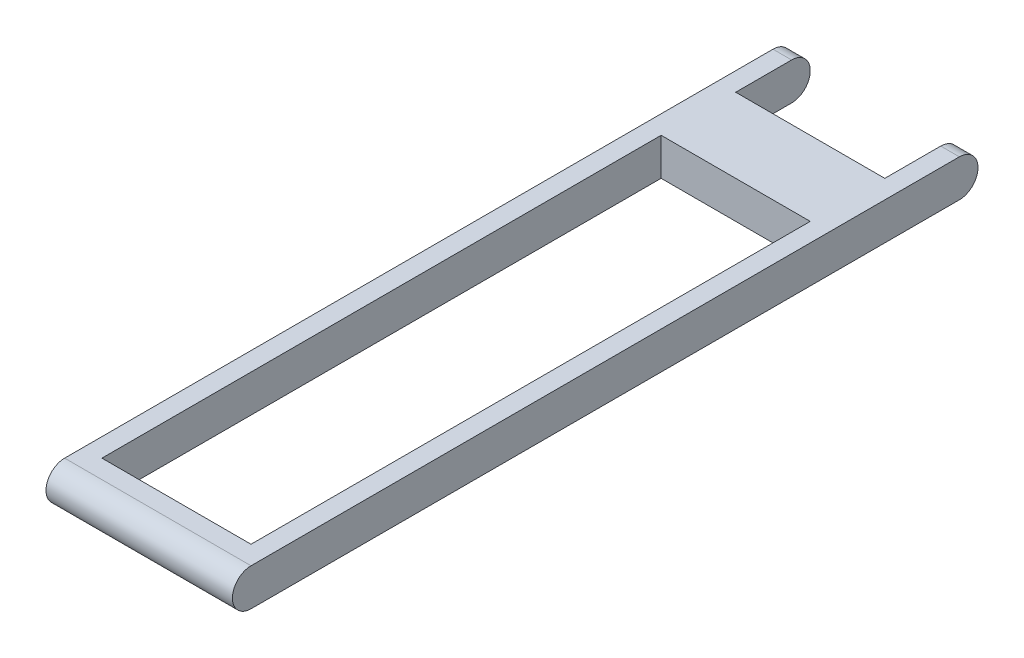
ISO-10303-21;
HEADER;
FILE_DESCRIPTION(('STEP AP214'),'2;1');
FILE_NAME('part.step','',(''),(''),'','','');
FILE_SCHEMA(('AUTOMOTIVE_DESIGN { 1 0 10303 214 1 1 1 1 }'));
ENDSEC;
DATA;
#1=APPLICATION_CONTEXT('core data for automotive mechanical design processes');
#2=APPLICATION_PROTOCOL_DEFINITION('international standard','automotive_design',2000,#1);
#3=PRODUCT_CONTEXT('',#1,'mechanical');
#4=PRODUCT('Part','Part','',(#3));
#5=PRODUCT_RELATED_PRODUCT_CATEGORY('part','',(#4));
#6=PRODUCT_DEFINITION_FORMATION('','',#4);
#7=PRODUCT_DEFINITION_CONTEXT('part definition',#1,'design');
#8=PRODUCT_DEFINITION('design','',#6,#7);
#9=PRODUCT_DEFINITION_SHAPE('','',#8);
#10=(LENGTH_UNIT() NAMED_UNIT(*) SI_UNIT(.MILLI.,.METRE.));
#11=(NAMED_UNIT(*) PLANE_ANGLE_UNIT() SI_UNIT($,.RADIAN.));
#12=(NAMED_UNIT(*) SI_UNIT($,.STERADIAN.) SOLID_ANGLE_UNIT());
#13=UNCERTAINTY_MEASURE_WITH_UNIT(LENGTH_MEASURE(1.E-05),#10,'distance_accuracy_value','');
#14=(GEOMETRIC_REPRESENTATION_CONTEXT(3) GLOBAL_UNCERTAINTY_ASSIGNED_CONTEXT((#13)) GLOBAL_UNIT_ASSIGNED_CONTEXT((#10,
#11,#12)) REPRESENTATION_CONTEXT('',''));
#15=CARTESIAN_POINT('',(0.,0.,0.));
#16=DIRECTION('',(0.,0.,1.));
#17=DIRECTION('',(1.,0.,0.));
#18=AXIS2_PLACEMENT_3D('',#15,#16,#17);
#19=CARTESIAN_POINT('',(10.,0.,-19.));
#20=DIRECTION('',(-1.,0.,0.));
#21=DIRECTION('',(0.,0.,1.));
#22=AXIS2_PLACEMENT_3D('',#19,#20,#21);
#23=CYLINDRICAL_SURFACE('',#22,1.);
#24=DIRECTION('',(-1.,0.,0.));
#25=VECTOR('',#24,1.);
#26=CARTESIAN_POINT('',(10.,1.00000000000001,-19.));
#27=LINE('',#26,#25);
#28=CARTESIAN_POINT('',(0.999999999999998,1.00000000000001,-19.));
#29=VERTEX_POINT('',#28);
#30=CARTESIAN_POINT('',(0.,1.00000000000001,-19.));
#31=VERTEX_POINT('',#30);
#32=EDGE_CURVE('E207',#29,#31,#27,.T.);
#33=ORIENTED_EDGE('',*,*,#32,.F.);
#34=CARTESIAN_POINT('',(0.999999999999997,0.,-19.));
#35=DIRECTION('',(-1.,0.,0.));
#36=DIRECTION('',(0.,0.,1.));
#37=AXIS2_PLACEMENT_3D('',#34,#35,#36);
#38=CIRCLE('',#37,1.);
#39=CARTESIAN_POINT('',(0.999999999999997,-0.999999999999993,-19.));
#40=VERTEX_POINT('',#39);
#41=EDGE_CURVE('E169',#29,#40,#38,.T.);
#42=ORIENTED_EDGE('',*,*,#41,.T.);
#43=DIRECTION('',(-1.,0.,0.));
#44=VECTOR('',#43,1.);
#45=CARTESIAN_POINT('',(10.,-0.999999999999993,-19.));
#46=LINE('',#45,#44);
#47=CARTESIAN_POINT('',(0.,-0.999999999999993,-19.));
#48=VERTEX_POINT('',#47);
#49=EDGE_CURVE('E211',#40,#48,#46,.T.);
#50=ORIENTED_EDGE('',*,*,#49,.T.);
#51=CARTESIAN_POINT('',(0.,0.,-19.));
#52=DIRECTION('',(1.,0.,0.));
#53=DIRECTION('',(0.,0.,-1.));
#54=AXIS2_PLACEMENT_3D('',#51,#52,#53);
#55=CIRCLE('',#54,1.);
#56=EDGE_CURVE('E201',#48,#31,#55,.T.);
#57=ORIENTED_EDGE('',*,*,#56,.T.);
#58=EDGE_LOOP('',(#33,#42,#50,#57));
#59=FACE_BOUND('',#58,.T.);
#60=ADVANCED_FACE('F34',(#59),#23,.T.);
#61=CARTESIAN_POINT('',(10.,0.,19.));
#62=DIRECTION('',(-1.,0.,0.));
#63=DIRECTION('',(0.,0.,1.));
#64=AXIS2_PLACEMENT_3D('',#61,#62,#63);
#65=CYLINDRICAL_SURFACE('',#64,1.);
#66=CARTESIAN_POINT('',(0.,0.,19.));
#67=DIRECTION('',(1.,0.,0.));
#68=DIRECTION('',(0.,0.,-1.));
#69=AXIS2_PLACEMENT_3D('',#66,#67,#68);
#70=CIRCLE('',#69,1.);
#71=CARTESIAN_POINT('',(0.,1.,19.));
#72=VERTEX_POINT('',#71);
#73=CARTESIAN_POINT('',(0.,-1.,19.));
#74=VERTEX_POINT('',#73);
#75=EDGE_CURVE('E184',#72,#74,#70,.T.);
#76=ORIENTED_EDGE('',*,*,#75,.T.);
#77=DIRECTION('',(-1.,0.,0.));
#78=VECTOR('',#77,1.);
#79=CARTESIAN_POINT('',(10.,-1.,19.));
#80=LINE('',#79,#78);
#81=CARTESIAN_POINT('',(10.,-1.,19.));
#82=VERTEX_POINT('',#81);
#83=EDGE_CURVE('E42',#82,#74,#80,.T.);
#84=ORIENTED_EDGE('',*,*,#83,.F.);
#85=CARTESIAN_POINT('',(10.,0.,19.));
#86=DIRECTION('',(1.,0.,0.));
#87=DIRECTION('',(0.,0.,-1.));
#88=AXIS2_PLACEMENT_3D('',#85,#86,#87);
#89=CIRCLE('',#88,1.);
#90=CARTESIAN_POINT('',(10.,1.,19.));
#91=VERTEX_POINT('',#90);
#92=EDGE_CURVE('E185',#91,#82,#89,.T.);
#93=ORIENTED_EDGE('',*,*,#92,.F.);
#94=DIRECTION('',(-1.,0.,0.));
#95=VECTOR('',#94,1.);
#96=CARTESIAN_POINT('',(10.,1.,19.));
#97=LINE('',#96,#95);
#98=EDGE_CURVE('E195',#91,#72,#97,.T.);
#99=ORIENTED_EDGE('',*,*,#98,.T.);
#100=EDGE_LOOP('',(#76,#84,#93,#99));
#101=FACE_BOUND('',#100,.T.);
#102=ADVANCED_FACE('F36',(#101),#65,.T.);
#103=CARTESIAN_POINT('',(10.,-1.,19.));
#104=DIRECTION('',(0.,1.,0.));
#105=DIRECTION('',(0.,0.,1.));
#106=AXIS2_PLACEMENT_3D('',#103,#104,#105);
#107=PLANE('',#106);
#108=DIRECTION('',(-1.,0.,0.));
#109=VECTOR('',#108,1.);
#110=CARTESIAN_POINT('',(10.,-0.999999999999994,-12.));
#111=LINE('',#110,#109);
#112=CARTESIAN_POINT('',(9.,-0.999999999999997,-12.));
#113=VERTEX_POINT('',#112);
#114=CARTESIAN_POINT('',(0.999999999999999,-0.999999999999994,-12.));
#115=VERTEX_POINT('',#114);
#116=EDGE_CURVE('E178',#113,#115,#111,.T.);
#117=ORIENTED_EDGE('',*,*,#116,.T.);
#118=DIRECTION('',(0.,0.,1.));
#119=VECTOR('',#118,1.);
#120=CARTESIAN_POINT('',(1.,-1.,19.));
#121=LINE('',#120,#119);
#122=CARTESIAN_POINT('',(1.,-0.999999999999999,18.));
#123=VERTEX_POINT('',#122);
#124=EDGE_CURVE('E181',#115,#123,#121,.T.);
#125=ORIENTED_EDGE('',*,*,#124,.T.);
#126=DIRECTION('',(1.,0.,0.));
#127=VECTOR('',#126,1.);
#128=CARTESIAN_POINT('',(10.,-1.,18.));
#129=LINE('',#128,#127);
#130=CARTESIAN_POINT('',(9.,-1.,18.));
#131=VERTEX_POINT('',#130);
#132=EDGE_CURVE('E175',#123,#131,#129,.T.);
#133=ORIENTED_EDGE('',*,*,#132,.T.);
#134=DIRECTION('',(0.,0.,-1.));
#135=VECTOR('',#134,1.);
#136=CARTESIAN_POINT('',(9.,-1.,19.));
#137=LINE('',#136,#135);
#138=EDGE_CURVE('E129',#131,#113,#137,.T.);
#139=ORIENTED_EDGE('',*,*,#138,.T.);
#140=EDGE_LOOP('',(#117,#125,#133,#139));
#141=FACE_BOUND('',#140,.T.);
#142=ORIENTED_EDGE('',*,*,#49,.F.);
#143=DIRECTION('',(0.,0.,1.));
#144=VECTOR('',#143,1.);
#145=CARTESIAN_POINT('',(1.,-1.,19.));
#146=LINE('',#145,#144);
#147=CARTESIAN_POINT('',(0.999999999999999,-0.999999999999994,-16.));
#148=VERTEX_POINT('',#147);
#149=EDGE_CURVE('E172',#40,#148,#146,.T.);
#150=ORIENTED_EDGE('',*,*,#149,.T.);
#151=DIRECTION('',(1.,0.,0.));
#152=VECTOR('',#151,1.);
#153=CARTESIAN_POINT('',(10.,-0.999999999999994,-16.));
#154=LINE('',#153,#152);
#155=CARTESIAN_POINT('',(9.,-0.999999999999994,-16.));
#156=VERTEX_POINT('',#155);
#157=EDGE_CURVE('E149',#148,#156,#154,.T.);
#158=ORIENTED_EDGE('',*,*,#157,.T.);
#159=DIRECTION('',(0.,0.,-1.));
#160=VECTOR('',#159,1.);
#161=CARTESIAN_POINT('',(9.,-1.,19.));
#162=LINE('',#161,#160);
#163=CARTESIAN_POINT('',(9.,-0.999999999999993,-19.));
#164=VERTEX_POINT('',#163);
#165=EDGE_CURVE('E166',#156,#164,#162,.T.);
#166=ORIENTED_EDGE('',*,*,#165,.T.);
#167=CARTESIAN_POINT('',(10.,-0.999999999999993,-19.));
#168=VERTEX_POINT('',#167);
#169=EDGE_CURVE('E212',#168,#164,#46,.T.);
#170=ORIENTED_EDGE('',*,*,#169,.F.);
#171=DIRECTION('',(0.,0.,-1.));
#172=VECTOR('',#171,1.);
#173=CARTESIAN_POINT('',(10.,-1.,19.));
#174=LINE('',#173,#172);
#175=EDGE_CURVE('E188',#82,#168,#174,.T.);
#176=ORIENTED_EDGE('',*,*,#175,.F.);
#177=ORIENTED_EDGE('',*,*,#83,.T.);
#178=DIRECTION('',(0.,0.,-1.));
#179=VECTOR('',#178,1.);
#180=CARTESIAN_POINT('',(0.,-1.,19.));
#181=LINE('',#180,#179);
#182=EDGE_CURVE('E198',#74,#48,#181,.T.);
#183=ORIENTED_EDGE('',*,*,#182,.T.);
#184=EDGE_LOOP('',(#142,#150,#158,#166,#170,#176,#177,#183));
#185=FACE_BOUND('',#184,.T.);
#186=ADVANCED_FACE('F218',(#141,#185),#107,.F.);
#187=ORIENTED_EDGE('',*,*,#169,.T.);
#188=CARTESIAN_POINT('',(9.,0.,-19.));
#189=DIRECTION('',(1.,0.,0.));
#190=DIRECTION('',(0.,0.,-1.));
#191=AXIS2_PLACEMENT_3D('',#188,#189,#190);
#192=CIRCLE('',#191,1.);
#193=CARTESIAN_POINT('',(9.,1.00000000000001,-19.));
#194=VERTEX_POINT('',#193);
#195=EDGE_CURVE('E163',#164,#194,#192,.T.);
#196=ORIENTED_EDGE('',*,*,#195,.T.);
#197=CARTESIAN_POINT('',(10.,1.00000000000001,-19.));
#198=VERTEX_POINT('',#197);
#199=EDGE_CURVE('E208',#198,#194,#27,.T.);
#200=ORIENTED_EDGE('',*,*,#199,.F.);
#201=CARTESIAN_POINT('',(10.,0.,-19.));
#202=DIRECTION('',(1.,0.,0.));
#203=DIRECTION('',(0.,0.,-1.));
#204=AXIS2_PLACEMENT_3D('',#201,#202,#203);
#205=CIRCLE('',#204,1.);
#206=EDGE_CURVE('E191',#168,#198,#205,.T.);
#207=ORIENTED_EDGE('',*,*,#206,.F.);
#208=EDGE_LOOP('',(#187,#196,#200,#207));
#209=FACE_BOUND('',#208,.T.);
#210=ADVANCED_FACE('F243',(#209),#23,.T.);
#211=CARTESIAN_POINT('',(10.,1.,19.));
#212=DIRECTION('',(0.,-1.,0.));
#213=DIRECTION('',(0.,0.,-1.));
#214=AXIS2_PLACEMENT_3D('',#211,#212,#213);
#215=PLANE('',#214);
#216=DIRECTION('',(1.,0.,0.));
#217=VECTOR('',#216,1.);
#218=CARTESIAN_POINT('',(1.,1.,18.));
#219=LINE('',#218,#217);
#220=CARTESIAN_POINT('',(1.,1.,18.));
#221=VERTEX_POINT('',#220);
#222=CARTESIAN_POINT('',(9.,1.,18.));
#223=VERTEX_POINT('',#222);
#224=EDGE_CURVE('E135',#221,#223,#219,.T.);
#225=ORIENTED_EDGE('',*,*,#224,.F.);
#226=DIRECTION('',(0.,0.,1.));
#227=VECTOR('',#226,1.);
#228=CARTESIAN_POINT('',(0.999999999999999,1.00000000000001,-12.));
#229=LINE('',#228,#227);
#230=CARTESIAN_POINT('',(0.999999999999999,1.00000000000001,-12.));
#231=VERTEX_POINT('',#230);
#232=EDGE_CURVE('E57',#231,#221,#229,.T.);
#233=ORIENTED_EDGE('',*,*,#232,.F.);
#234=DIRECTION('',(-1.,0.,0.));
#235=VECTOR('',#234,1.);
#236=CARTESIAN_POINT('',(0.999999999999999,1.00000000000001,-12.));
#237=LINE('',#236,#235);
#238=CARTESIAN_POINT('',(9.,1.00000000000001,-12.));
#239=VERTEX_POINT('',#238);
#240=EDGE_CURVE('E142',#239,#231,#237,.T.);
#241=ORIENTED_EDGE('',*,*,#240,.F.);
#242=DIRECTION('',(0.,0.,-1.));
#243=VECTOR('',#242,1.);
#244=CARTESIAN_POINT('',(9.,1.00000000000001,-12.));
#245=LINE('',#244,#243);
#246=EDGE_CURVE('E126',#223,#239,#245,.T.);
#247=ORIENTED_EDGE('',*,*,#246,.F.);
#248=EDGE_LOOP('',(#225,#233,#241,#247));
#249=FACE_BOUND('',#248,.T.);
#250=DIRECTION('',(1.,0.,0.));
#251=VECTOR('',#250,1.);
#252=CARTESIAN_POINT('',(0.999999999999999,1.00000000000001,-16.));
#253=LINE('',#252,#251);
#254=CARTESIAN_POINT('',(0.999999999999997,1.00000000000001,-16.));
#255=VERTEX_POINT('',#254);
#256=CARTESIAN_POINT('',(9.,1.00000000000001,-16.));
#257=VERTEX_POINT('',#256);
#258=EDGE_CURVE('E152',#255,#257,#253,.T.);
#259=ORIENTED_EDGE('',*,*,#258,.F.);
#260=DIRECTION('',(0.,0.,-1.));
#261=VECTOR('',#260,1.);
#262=CARTESIAN_POINT('',(1.,1.,19.));
#263=LINE('',#262,#261);
#264=EDGE_CURVE('E11',#255,#29,#263,.T.);
#265=ORIENTED_EDGE('',*,*,#264,.T.);
#266=ORIENTED_EDGE('',*,*,#32,.T.);
#267=DIRECTION('',(0.,0.,1.));
#268=VECTOR('',#267,1.);
#269=CARTESIAN_POINT('',(0.,1.,19.));
#270=LINE('',#269,#268);
#271=EDGE_CURVE('E189',#31,#72,#270,.T.);
#272=ORIENTED_EDGE('',*,*,#271,.T.);
#273=ORIENTED_EDGE('',*,*,#98,.F.);
#274=DIRECTION('',(0.,0.,1.));
#275=VECTOR('',#274,1.);
#276=CARTESIAN_POINT('',(10.,1.,19.));
#277=LINE('',#276,#275);
#278=EDGE_CURVE('E193',#198,#91,#277,.T.);
#279=ORIENTED_EDGE('',*,*,#278,.F.);
#280=ORIENTED_EDGE('',*,*,#199,.T.);
#281=DIRECTION('',(0.,0.,-1.));
#282=VECTOR('',#281,1.);
#283=CARTESIAN_POINT('',(9.,1.00000000000001,-23.5118377713963));
#284=LINE('',#283,#282);
#285=EDGE_CURVE('E155',#257,#194,#284,.T.);
#286=ORIENTED_EDGE('',*,*,#285,.F.);
#287=EDGE_LOOP('',(#259,#265,#266,#272,#273,#279,#280,#286));
#288=FACE_BOUND('',#287,.T.);
#289=ADVANCED_FACE('F139',(#249,#288),#215,.F.);
#290=CARTESIAN_POINT('',(10.,0.,19.));
#291=DIRECTION('',(1.,0.,0.));
#292=DIRECTION('',(0.,0.,-1.));
#293=AXIS2_PLACEMENT_3D('',#290,#291,#292);
#294=PLANE('',#293);
#295=ORIENTED_EDGE('',*,*,#92,.T.);
#296=ORIENTED_EDGE('',*,*,#175,.T.);
#297=ORIENTED_EDGE('',*,*,#206,.T.);
#298=ORIENTED_EDGE('',*,*,#278,.T.);
#299=EDGE_LOOP('',(#295,#296,#297,#298));
#300=FACE_BOUND('',#299,.T.);
#301=ADVANCED_FACE('F247',(#300),#294,.T.);
#302=CARTESIAN_POINT('',(0.,0.,19.));
#303=DIRECTION('',(1.,0.,0.));
#304=DIRECTION('',(0.,0.,-1.));
#305=AXIS2_PLACEMENT_3D('',#302,#303,#304);
#306=PLANE('',#305);
#307=ORIENTED_EDGE('',*,*,#75,.F.);
#308=ORIENTED_EDGE('',*,*,#271,.F.);
#309=ORIENTED_EDGE('',*,*,#56,.F.);
#310=ORIENTED_EDGE('',*,*,#182,.F.);
#311=EDGE_LOOP('',(#307,#308,#309,#310));
#312=FACE_BOUND('',#311,.T.);
#313=ADVANCED_FACE('F227',(#312),#306,.F.);
#314=CARTESIAN_POINT('',(0.999999999999997,-8.99999999999999,-23.5118377713963));
#315=DIRECTION('',(-1.,0.,0.));
#316=DIRECTION('',(0.,0.,1.));
#317=AXIS2_PLACEMENT_3D('',#314,#315,#316);
#318=PLANE('',#317);
#319=ORIENTED_EDGE('',*,*,#41,.F.);
#320=ORIENTED_EDGE('',*,*,#264,.F.);
#321=DIRECTION('',(0.,1.,0.));
#322=VECTOR('',#321,1.);
#323=CARTESIAN_POINT('',(0.999999999999999,-8.99999999999999,-16.));
#324=LINE('',#323,#322);
#325=EDGE_CURVE('E157',#148,#255,#324,.T.);
#326=ORIENTED_EDGE('',*,*,#325,.F.);
#327=ORIENTED_EDGE('',*,*,#149,.F.);
#328=EDGE_LOOP('',(#319,#320,#326,#327));
#329=FACE_BOUND('',#328,.T.);
#330=ADVANCED_FACE('F232',(#329),#318,.F.);
#331=CARTESIAN_POINT('',(9.,-8.99999999999999,-23.5118377713963));
#332=DIRECTION('',(1.,0.,0.));
#333=DIRECTION('',(0.,0.,-1.));
#334=AXIS2_PLACEMENT_3D('',#331,#332,#333);
#335=PLANE('',#334);
#336=DIRECTION('',(0.,1.,0.));
#337=VECTOR('',#336,1.);
#338=CARTESIAN_POINT('',(9.,-8.99999999999999,-16.));
#339=LINE('',#338,#337);
#340=EDGE_CURVE('E158',#156,#257,#339,.T.);
#341=ORIENTED_EDGE('',*,*,#340,.T.);
#342=ORIENTED_EDGE('',*,*,#285,.T.);
#343=ORIENTED_EDGE('',*,*,#195,.F.);
#344=ORIENTED_EDGE('',*,*,#165,.F.);
#345=EDGE_LOOP('',(#341,#342,#343,#344));
#346=FACE_BOUND('',#345,.T.);
#347=ADVANCED_FACE('F240',(#346),#335,.F.);
#348=CARTESIAN_POINT('',(0.999999999999999,-8.99999999999999,-16.));
#349=DIRECTION('',(0.,0.,1.));
#350=DIRECTION('',(0.,-1.,0.));
#351=AXIS2_PLACEMENT_3D('',#348,#349,#350);
#352=PLANE('',#351);
#353=ORIENTED_EDGE('',*,*,#325,.T.);
#354=ORIENTED_EDGE('',*,*,#258,.T.);
#355=ORIENTED_EDGE('',*,*,#340,.F.);
#356=ORIENTED_EDGE('',*,*,#157,.F.);
#357=EDGE_LOOP('',(#353,#354,#355,#356));
#358=FACE_BOUND('',#357,.T.);
#359=ADVANCED_FACE('F236',(#358),#352,.F.);
#360=CARTESIAN_POINT('',(0.999999999999999,-8.99999999999999,-12.));
#361=DIRECTION('',(-1.,0.,0.));
#362=DIRECTION('',(0.,0.,1.));
#363=AXIS2_PLACEMENT_3D('',#360,#361,#362);
#364=PLANE('',#363);
#365=DIRECTION('',(0.,1.,0.));
#366=VECTOR('',#365,1.);
#367=CARTESIAN_POINT('',(0.999999999999999,-8.99999999999999,-12.));
#368=LINE('',#367,#366);
#369=EDGE_CURVE('E147',#115,#231,#368,.T.);
#370=ORIENTED_EDGE('',*,*,#369,.T.);
#371=ORIENTED_EDGE('',*,*,#232,.T.);
#372=DIRECTION('',(0.,1.,0.));
#373=VECTOR('',#372,1.);
#374=CARTESIAN_POINT('',(1.,-9.,18.));
#375=LINE('',#374,#373);
#376=EDGE_CURVE('E132',#123,#221,#375,.T.);
#377=ORIENTED_EDGE('',*,*,#376,.F.);
#378=ORIENTED_EDGE('',*,*,#124,.F.);
#379=EDGE_LOOP('',(#370,#371,#377,#378));
#380=FACE_BOUND('',#379,.T.);
#381=ADVANCED_FACE('F268',(#380),#364,.F.);
#382=CARTESIAN_POINT('',(0.999999999999999,-8.99999999999999,-12.));
#383=DIRECTION('',(0.,0.,-1.));
#384=DIRECTION('',(0.,1.,0.));
#385=AXIS2_PLACEMENT_3D('',#382,#383,#384);
#386=PLANE('',#385);
#387=DIRECTION('',(0.,1.,0.));
#388=VECTOR('',#387,1.);
#389=CARTESIAN_POINT('',(9.,-8.99999999999999,-12.));
#390=LINE('',#389,#388);
#391=EDGE_CURVE('E131',#113,#239,#390,.T.);
#392=ORIENTED_EDGE('',*,*,#391,.T.);
#393=ORIENTED_EDGE('',*,*,#240,.T.);
#394=ORIENTED_EDGE('',*,*,#369,.F.);
#395=ORIENTED_EDGE('',*,*,#116,.F.);
#396=EDGE_LOOP('',(#392,#393,#394,#395));
#397=FACE_BOUND('',#396,.T.);
#398=ADVANCED_FACE('F267',(#397),#386,.F.);
#399=CARTESIAN_POINT('',(9.,-8.99999999999999,-12.));
#400=DIRECTION('',(1.,0.,0.));
#401=DIRECTION('',(0.,0.,-1.));
#402=AXIS2_PLACEMENT_3D('',#399,#400,#401);
#403=PLANE('',#402);
#404=DIRECTION('',(0.,1.,0.));
#405=VECTOR('',#404,1.);
#406=CARTESIAN_POINT('',(9.,-9.,18.));
#407=LINE('',#406,#405);
#408=EDGE_CURVE('E49',#131,#223,#407,.T.);
#409=ORIENTED_EDGE('',*,*,#408,.T.);
#410=ORIENTED_EDGE('',*,*,#246,.T.);
#411=ORIENTED_EDGE('',*,*,#391,.F.);
#412=ORIENTED_EDGE('',*,*,#138,.F.);
#413=EDGE_LOOP('',(#409,#410,#411,#412));
#414=FACE_BOUND('',#413,.T.);
#415=ADVANCED_FACE('F123',(#414),#403,.F.);
#416=CARTESIAN_POINT('',(1.,-9.,18.));
#417=DIRECTION('',(0.,0.,1.));
#418=DIRECTION('',(0.,-1.,0.));
#419=AXIS2_PLACEMENT_3D('',#416,#417,#418);
#420=PLANE('',#419);
#421=ORIENTED_EDGE('',*,*,#376,.T.);
#422=ORIENTED_EDGE('',*,*,#224,.T.);
#423=ORIENTED_EDGE('',*,*,#408,.F.);
#424=ORIENTED_EDGE('',*,*,#132,.F.);
#425=EDGE_LOOP('',(#421,#422,#423,#424));
#426=FACE_BOUND('',#425,.T.);
#427=ADVANCED_FACE('F136',(#426),#420,.F.);
#428=CLOSED_SHELL('',(#60,#102,#186,#210,#289,#301,#313,#330,#347,#359,#381,#398,#415,#427));
#429=MANIFOLD_SOLID_BREP('B2',#428);
#430=ADVANCED_BREP_SHAPE_REPRESENTATION('',(#18,#429),#14);
#431=SHAPE_DEFINITION_REPRESENTATION(#9,#430);
ENDSEC;
END-ISO-10303-21;
